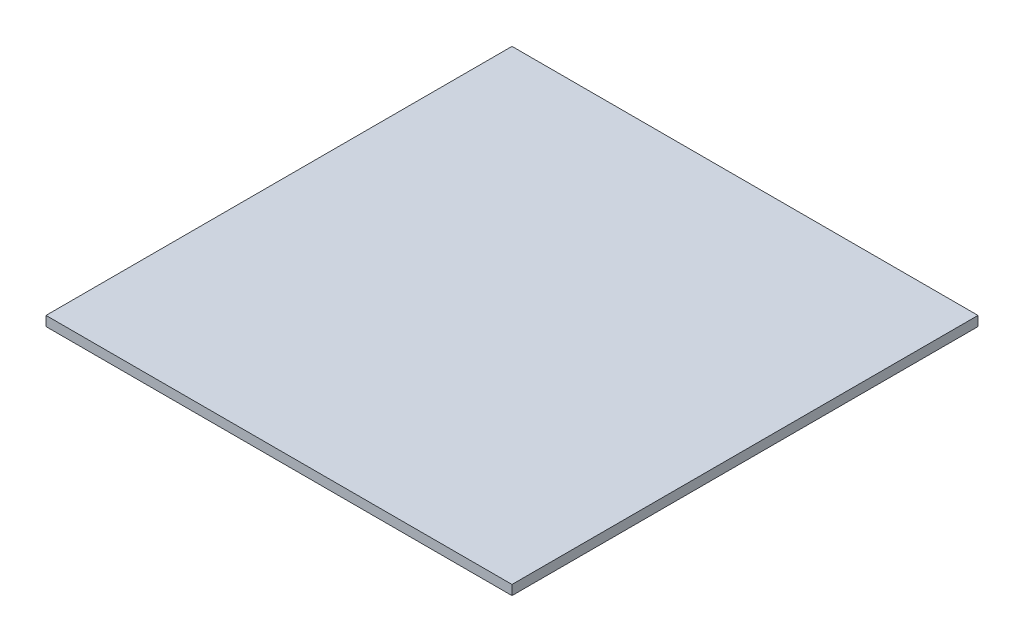
ISO-10303-21;
HEADER;
FILE_DESCRIPTION(('STEP AP214'),'2;1');
FILE_NAME('part.step','',(''),(''),'','','');
FILE_SCHEMA(('AUTOMOTIVE_DESIGN { 1 0 10303 214 1 1 1 1 }'));
ENDSEC;
DATA;
#1=APPLICATION_CONTEXT('core data for automotive mechanical design processes');
#2=APPLICATION_PROTOCOL_DEFINITION('international standard','automotive_design',2000,#1);
#3=PRODUCT_CONTEXT('',#1,'mechanical');
#4=PRODUCT('Part','Part','',(#3));
#5=PRODUCT_RELATED_PRODUCT_CATEGORY('part','',(#4));
#6=PRODUCT_DEFINITION_FORMATION('','',#4);
#7=PRODUCT_DEFINITION_CONTEXT('part definition',#1,'design');
#8=PRODUCT_DEFINITION('design','',#6,#7);
#9=PRODUCT_DEFINITION_SHAPE('','',#8);
#10=(LENGTH_UNIT() NAMED_UNIT(*) SI_UNIT(.MILLI.,.METRE.));
#11=(NAMED_UNIT(*) PLANE_ANGLE_UNIT() SI_UNIT($,.RADIAN.));
#12=(NAMED_UNIT(*) SI_UNIT($,.STERADIAN.) SOLID_ANGLE_UNIT());
#13=UNCERTAINTY_MEASURE_WITH_UNIT(LENGTH_MEASURE(1.E-05),#10,'distance_accuracy_value','');
#14=(GEOMETRIC_REPRESENTATION_CONTEXT(3) GLOBAL_UNCERTAINTY_ASSIGNED_CONTEXT((#13)) GLOBAL_UNIT_ASSIGNED_CONTEXT((#10,
#11,#12)) REPRESENTATION_CONTEXT('',''));
#15=CARTESIAN_POINT('',(0.,0.,0.));
#16=DIRECTION('',(0.,0.,1.));
#17=DIRECTION('',(1.,0.,0.));
#18=AXIS2_PLACEMENT_3D('',#15,#16,#17);
#19=CARTESIAN_POINT('',(152.4,6.35,152.4));
#20=DIRECTION('',(-1.,0.,0.));
#21=DIRECTION('',(0.,0.,1.));
#22=AXIS2_PLACEMENT_3D('',#19,#20,#21);
#23=PLANE('',#22);
#24=DIRECTION('',(0.,0.,-1.));
#25=VECTOR('',#24,1.);
#26=CARTESIAN_POINT('',(152.4,0.,152.4));
#27=LINE('',#26,#25);
#28=CARTESIAN_POINT('',(152.4,0.,152.4));
#29=VERTEX_POINT('',#28);
#30=CARTESIAN_POINT('',(152.4,0.,-152.4));
#31=VERTEX_POINT('',#30);
#32=EDGE_CURVE('E96',#29,#31,#27,.T.);
#33=ORIENTED_EDGE('',*,*,#32,.T.);
#34=DIRECTION('',(0.,-1.,0.));
#35=VECTOR('',#34,1.);
#36=CARTESIAN_POINT('',(152.4,6.35,-152.4));
#37=LINE('',#36,#35);
#38=CARTESIAN_POINT('',(152.4,6.35,-152.4));
#39=VERTEX_POINT('',#38);
#40=EDGE_CURVE('E11',#39,#31,#37,.T.);
#41=ORIENTED_EDGE('',*,*,#40,.F.);
#42=DIRECTION('',(0.,0.,-1.));
#43=VECTOR('',#42,1.);
#44=CARTESIAN_POINT('',(152.4,6.35,152.4));
#45=LINE('',#44,#43);
#46=CARTESIAN_POINT('',(152.4,6.35,152.4));
#47=VERTEX_POINT('',#46);
#48=EDGE_CURVE('E84',#47,#39,#45,.T.);
#49=ORIENTED_EDGE('',*,*,#48,.F.);
#50=DIRECTION('',(0.,-1.,0.));
#51=VECTOR('',#50,1.);
#52=CARTESIAN_POINT('',(152.4,6.35,152.4));
#53=LINE('',#52,#51);
#54=EDGE_CURVE('E92',#47,#29,#53,.T.);
#55=ORIENTED_EDGE('',*,*,#54,.T.);
#56=EDGE_LOOP('',(#33,#41,#49,#55));
#57=FACE_BOUND('',#56,.T.);
#58=ADVANCED_FACE('F33',(#57),#23,.F.);
#59=CARTESIAN_POINT('',(-152.4,6.35,-152.4));
#60=DIRECTION('',(0.,0.,1.));
#61=DIRECTION('',(1.,0.,0.));
#62=AXIS2_PLACEMENT_3D('',#59,#60,#61);
#63=PLANE('',#62);
#64=DIRECTION('',(-1.,0.,0.));
#65=VECTOR('',#64,1.);
#66=CARTESIAN_POINT('',(-152.4,0.,-152.4));
#67=LINE('',#66,#65);
#68=CARTESIAN_POINT('',(-152.4,0.,-152.4));
#69=VERTEX_POINT('',#68);
#70=EDGE_CURVE('E88',#31,#69,#67,.T.);
#71=ORIENTED_EDGE('',*,*,#70,.T.);
#72=DIRECTION('',(0.,-1.,0.));
#73=VECTOR('',#72,1.);
#74=CARTESIAN_POINT('',(-152.4,6.35,-152.4));
#75=LINE('',#74,#73);
#76=CARTESIAN_POINT('',(-152.4,6.35,-152.4));
#77=VERTEX_POINT('',#76);
#78=EDGE_CURVE('E41',#77,#69,#75,.T.);
#79=ORIENTED_EDGE('',*,*,#78,.F.);
#80=DIRECTION('',(-1.,0.,0.));
#81=VECTOR('',#80,1.);
#82=CARTESIAN_POINT('',(-152.4,6.35,-152.4));
#83=LINE('',#82,#81);
#84=EDGE_CURVE('E79',#39,#77,#83,.T.);
#85=ORIENTED_EDGE('',*,*,#84,.F.);
#86=ORIENTED_EDGE('',*,*,#40,.T.);
#87=EDGE_LOOP('',(#71,#79,#85,#86));
#88=FACE_BOUND('',#87,.T.);
#89=ADVANCED_FACE('F87',(#88),#63,.F.);
#90=CARTESIAN_POINT('',(-152.4,6.35,152.4));
#91=DIRECTION('',(1.,0.,0.));
#92=DIRECTION('',(0.,0.,-1.));
#93=AXIS2_PLACEMENT_3D('',#90,#91,#92);
#94=PLANE('',#93);
#95=DIRECTION('',(0.,0.,1.));
#96=VECTOR('',#95,1.);
#97=CARTESIAN_POINT('',(-152.4,0.,152.4));
#98=LINE('',#97,#96);
#99=CARTESIAN_POINT('',(-152.4,0.,152.4));
#100=VERTEX_POINT('',#99);
#101=EDGE_CURVE('E66',#69,#100,#98,.T.);
#102=ORIENTED_EDGE('',*,*,#101,.T.);
#103=DIRECTION('',(0.,-1.,0.));
#104=VECTOR('',#103,1.);
#105=CARTESIAN_POINT('',(-152.4,6.35,152.4));
#106=LINE('',#105,#104);
#107=CARTESIAN_POINT('',(-152.4,6.35,152.4));
#108=VERTEX_POINT('',#107);
#109=EDGE_CURVE('E89',#108,#100,#106,.T.);
#110=ORIENTED_EDGE('',*,*,#109,.F.);
#111=DIRECTION('',(0.,0.,1.));
#112=VECTOR('',#111,1.);
#113=CARTESIAN_POINT('',(-152.4,6.35,152.4));
#114=LINE('',#113,#112);
#115=EDGE_CURVE('E82',#77,#108,#114,.T.);
#116=ORIENTED_EDGE('',*,*,#115,.F.);
#117=ORIENTED_EDGE('',*,*,#78,.T.);
#118=EDGE_LOOP('',(#102,#110,#116,#117));
#119=FACE_BOUND('',#118,.T.);
#120=ADVANCED_FACE('F90',(#119),#94,.F.);
#121=CARTESIAN_POINT('',(-152.4,6.35,152.4));
#122=DIRECTION('',(0.,0.,-1.));
#123=DIRECTION('',(-1.,0.,0.));
#124=AXIS2_PLACEMENT_3D('',#121,#122,#123);
#125=PLANE('',#124);
#126=DIRECTION('',(1.,0.,0.));
#127=VECTOR('',#126,1.);
#128=CARTESIAN_POINT('',(-152.4,0.,152.4));
#129=LINE('',#128,#127);
#130=EDGE_CURVE('E72',#100,#29,#129,.T.);
#131=ORIENTED_EDGE('',*,*,#130,.T.);
#132=ORIENTED_EDGE('',*,*,#54,.F.);
#133=DIRECTION('',(1.,0.,0.));
#134=VECTOR('',#133,1.);
#135=CARTESIAN_POINT('',(-152.4,6.35,152.4));
#136=LINE('',#135,#134);
#137=EDGE_CURVE('E49',#108,#47,#136,.T.);
#138=ORIENTED_EDGE('',*,*,#137,.F.);
#139=ORIENTED_EDGE('',*,*,#109,.T.);
#140=EDGE_LOOP('',(#131,#132,#138,#139));
#141=FACE_BOUND('',#140,.T.);
#142=ADVANCED_FACE('F103',(#141),#125,.F.);
#143=CARTESIAN_POINT('',(0.,6.35,0.));
#144=DIRECTION('',(0.,-1.,0.));
#145=DIRECTION('',(0.,0.,-1.));
#146=AXIS2_PLACEMENT_3D('',#143,#144,#145);
#147=PLANE('',#146);
#148=ORIENTED_EDGE('',*,*,#48,.T.);
#149=ORIENTED_EDGE('',*,*,#84,.T.);
#150=ORIENTED_EDGE('',*,*,#115,.T.);
#151=ORIENTED_EDGE('',*,*,#137,.T.);
#152=EDGE_LOOP('',(#148,#149,#150,#151));
#153=FACE_BOUND('',#152,.T.);
#154=ADVANCED_FACE('F80',(#153),#147,.F.);
#155=CARTESIAN_POINT('',(0.,0.,0.));
#156=DIRECTION('',(0.,-1.,0.));
#157=DIRECTION('',(0.,0.,-1.));
#158=AXIS2_PLACEMENT_3D('',#155,#156,#157);
#159=PLANE('',#158);
#160=ORIENTED_EDGE('',*,*,#32,.F.);
#161=ORIENTED_EDGE('',*,*,#130,.F.);
#162=ORIENTED_EDGE('',*,*,#101,.F.);
#163=ORIENTED_EDGE('',*,*,#70,.F.);
#164=EDGE_LOOP('',(#160,#161,#162,#163));
#165=FACE_BOUND('',#164,.T.);
#166=ADVANCED_FACE('F106',(#165),#159,.T.);
#167=CLOSED_SHELL('',(#58,#89,#120,#142,#154,#166));
#168=MANIFOLD_SOLID_BREP('B2',#167);
#169=ADVANCED_BREP_SHAPE_REPRESENTATION('',(#18,#168),#14);
#170=SHAPE_DEFINITION_REPRESENTATION(#9,#169);
ENDSEC;
END-ISO-10303-21;
